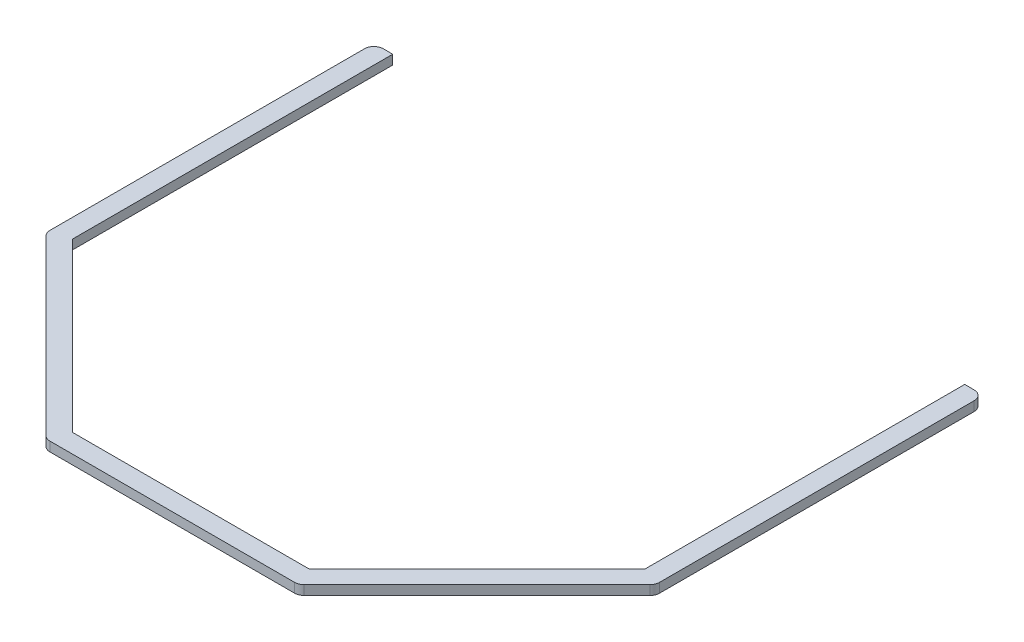
ISO-10303-21;
HEADER;
FILE_DESCRIPTION(('STEP AP214'),'2;1');
FILE_NAME('part.step','',(''),(''),'','','');
FILE_SCHEMA(('AUTOMOTIVE_DESIGN { 1 0 10303 214 1 1 1 1 }'));
ENDSEC;
DATA;
#1=APPLICATION_CONTEXT('core data for automotive mechanical design processes');
#2=APPLICATION_PROTOCOL_DEFINITION('international standard','automotive_design',2000,#1);
#3=PRODUCT_CONTEXT('',#1,'mechanical');
#4=PRODUCT('Part','Part','',(#3));
#5=PRODUCT_RELATED_PRODUCT_CATEGORY('part','',(#4));
#6=PRODUCT_DEFINITION_FORMATION('','',#4);
#7=PRODUCT_DEFINITION_CONTEXT('part definition',#1,'design');
#8=PRODUCT_DEFINITION('design','',#6,#7);
#9=PRODUCT_DEFINITION_SHAPE('','',#8);
#10=(LENGTH_UNIT() NAMED_UNIT(*) SI_UNIT(.MILLI.,.METRE.));
#11=(NAMED_UNIT(*) PLANE_ANGLE_UNIT() SI_UNIT($,.RADIAN.));
#12=(NAMED_UNIT(*) SI_UNIT($,.STERADIAN.) SOLID_ANGLE_UNIT());
#13=UNCERTAINTY_MEASURE_WITH_UNIT(LENGTH_MEASURE(1.E-05),#10,'distance_accuracy_value','');
#14=(GEOMETRIC_REPRESENTATION_CONTEXT(3) GLOBAL_UNCERTAINTY_ASSIGNED_CONTEXT((#13)) GLOBAL_UNIT_ASSIGNED_CONTEXT((#10,
#11,#12)) REPRESENTATION_CONTEXT('',''));
#15=CARTESIAN_POINT('',(0.,0.,0.));
#16=DIRECTION('',(0.,0.,1.));
#17=DIRECTION('',(1.,0.,0.));
#18=AXIS2_PLACEMENT_3D('',#15,#16,#17);
#19=CARTESIAN_POINT('',(-199.067689271226,6.35,-135.886792847484));
#20=DIRECTION('',(0.,0.,1.));
#21=DIRECTION('',(1.,0.,0.));
#22=AXIS2_PLACEMENT_3D('',#19,#20,#21);
#23=PLANE('',#22);
#24=DIRECTION('',(-1.,0.,0.));
#25=VECTOR('',#24,1.);
#26=CARTESIAN_POINT('',(-199.067689271226,0.,-135.886792847484));
#27=LINE('',#26,#25);
#28=CARTESIAN_POINT('',(-192.717689271226,0.,-135.886792847484));
#29=VERTEX_POINT('',#28);
#30=CARTESIAN_POINT('',(-199.067689271226,0.,-135.886792847484));
#31=VERTEX_POINT('',#30);
#32=EDGE_CURVE('E186',#29,#31,#27,.T.);
#33=ORIENTED_EDGE('',*,*,#32,.T.);
#34=DIRECTION('',(0.,-1.,0.));
#35=VECTOR('',#34,1.);
#36=CARTESIAN_POINT('',(-199.067689271226,6.35,-135.886792847484));
#37=LINE('',#36,#35);
#38=CARTESIAN_POINT('',(-199.067689271226,6.35,-135.886792847484));
#39=VERTEX_POINT('',#38);
#40=EDGE_CURVE('E11',#39,#31,#37,.T.);
#41=ORIENTED_EDGE('',*,*,#40,.F.);
#42=DIRECTION('',(-1.,0.,0.));
#43=VECTOR('',#42,1.);
#44=CARTESIAN_POINT('',(-199.067689271226,6.35,-135.886792847484));
#45=LINE('',#44,#43);
#46=CARTESIAN_POINT('',(-192.717689271226,6.35,-135.886792847484));
#47=VERTEX_POINT('',#46);
#48=EDGE_CURVE('E222',#47,#39,#45,.T.);
#49=ORIENTED_EDGE('',*,*,#48,.F.);
#50=DIRECTION('',(0.,-1.,0.));
#51=VECTOR('',#50,1.);
#52=CARTESIAN_POINT('',(-192.717689271226,6.35,-135.886792847484));
#53=LINE('',#52,#51);
#54=EDGE_CURVE('E182',#47,#29,#53,.T.);
#55=ORIENTED_EDGE('',*,*,#54,.T.);
#56=EDGE_LOOP('',(#33,#41,#49,#55));
#57=FACE_BOUND('',#56,.T.);
#58=ADVANCED_FACE('F30',(#57),#23,.F.);
#59=CARTESIAN_POINT('',(-199.067689271226,6.35,-129.536792847484));
#60=DIRECTION('',(0.,-1.,0.));
#61=DIRECTION('',(0.,0.,-1.));
#62=AXIS2_PLACEMENT_3D('',#59,#60,#61);
#63=CYLINDRICAL_SURFACE('',#62,6.34999999999999);
#64=CARTESIAN_POINT('',(-199.067689271226,0.,-129.536792847484));
#65=DIRECTION('',(0.,1.,0.));
#66=DIRECTION('',(0.,0.,-1.));
#67=AXIS2_PLACEMENT_3D('',#64,#65,#66);
#68=CIRCLE('',#67,6.34999999999999);
#69=CARTESIAN_POINT('',(-205.417689271226,0.,-129.536792847484));
#70=VERTEX_POINT('',#69);
#71=EDGE_CURVE('E189',#31,#70,#68,.T.);
#72=ORIENTED_EDGE('',*,*,#71,.T.);
#73=DIRECTION('',(0.,-1.,0.));
#74=VECTOR('',#73,1.);
#75=CARTESIAN_POINT('',(-205.417689271226,6.35,-129.536792847484));
#76=LINE('',#75,#74);
#77=CARTESIAN_POINT('',(-205.417689271226,6.35,-129.536792847484));
#78=VERTEX_POINT('',#77);
#79=EDGE_CURVE('E38',#78,#70,#76,.T.);
#80=ORIENTED_EDGE('',*,*,#79,.F.);
#81=CARTESIAN_POINT('',(-199.067689271226,6.35,-129.536792847484));
#82=DIRECTION('',(0.,1.,0.));
#83=DIRECTION('',(0.,0.,-1.));
#84=AXIS2_PLACEMENT_3D('',#81,#82,#83);
#85=CIRCLE('',#84,6.34999999999999);
#86=EDGE_CURVE('E119',#39,#78,#85,.T.);
#87=ORIENTED_EDGE('',*,*,#86,.F.);
#88=ORIENTED_EDGE('',*,*,#40,.T.);
#89=EDGE_LOOP('',(#72,#80,#87,#88));
#90=FACE_BOUND('',#89,.T.);
#91=ADVANCED_FACE('F267',(#90),#63,.T.);
#92=CARTESIAN_POINT('',(-205.417689271226,6.35,-85.0867928474841));
#93=DIRECTION('',(1.,0.,0.));
#94=DIRECTION('',(0.,0.,-1.));
#95=AXIS2_PLACEMENT_3D('',#92,#93,#94);
#96=PLANE('',#95);
#97=DIRECTION('',(0.,0.,1.));
#98=VECTOR('',#97,1.);
#99=CARTESIAN_POINT('',(-205.417689271226,0.,-85.0867928474841));
#100=LINE('',#99,#98);
#101=CARTESIAN_POINT('',(-205.417689271226,0.,82.4565367264149));
#102=VERTEX_POINT('',#101);
#103=EDGE_CURVE('E192',#70,#102,#100,.T.);
#104=ORIENTED_EDGE('',*,*,#103,.T.);
#105=DIRECTION('',(0.,-1.,0.));
#106=VECTOR('',#105,1.);
#107=CARTESIAN_POINT('',(-205.417689271226,6.35,82.4565367264149));
#108=LINE('',#107,#106);
#109=CARTESIAN_POINT('',(-205.417689271226,6.35,82.4565367264149));
#110=VERTEX_POINT('',#109);
#111=EDGE_CURVE('E259',#110,#102,#108,.T.);
#112=ORIENTED_EDGE('',*,*,#111,.F.);
#113=DIRECTION('',(0.,0.,1.));
#114=VECTOR('',#113,1.);
#115=CARTESIAN_POINT('',(-205.417689271226,6.35,-85.0867928474841));
#116=LINE('',#115,#114);
#117=EDGE_CURVE('E266',#78,#110,#116,.T.);
#118=ORIENTED_EDGE('',*,*,#117,.F.);
#119=ORIENTED_EDGE('',*,*,#79,.T.);
#120=EDGE_LOOP('',(#104,#112,#118,#119));
#121=FACE_BOUND('',#120,.T.);
#122=ADVANCED_FACE('F264',(#121),#96,.F.);
#123=CARTESIAN_POINT('',(-199.067689271226,6.35,82.4565367264149));
#124=DIRECTION('',(0.,-1.,0.));
#125=DIRECTION('',(0.,0.,-1.));
#126=AXIS2_PLACEMENT_3D('',#123,#124,#125);
#127=CYLINDRICAL_SURFACE('',#126,6.34999999999999);
#128=CARTESIAN_POINT('',(-199.067689271226,0.,82.4565367264149));
#129=DIRECTION('',(0.,1.,0.));
#130=DIRECTION('',(0.,0.,1.));
#131=AXIS2_PLACEMENT_3D('',#128,#129,#130);
#132=CIRCLE('',#131,6.34999999999999);
#133=CARTESIAN_POINT('',(-203.557817331761,0.,86.9466647869495));
#134=VERTEX_POINT('',#133);
#135=EDGE_CURVE('E194',#102,#134,#132,.T.);
#136=ORIENTED_EDGE('',*,*,#135,.T.);
#137=DIRECTION('',(0.,-1.,0.));
#138=VECTOR('',#137,1.);
#139=CARTESIAN_POINT('',(-203.557817331761,6.35,86.9466647869495));
#140=LINE('',#139,#138);
#141=CARTESIAN_POINT('',(-203.557817331761,6.35,86.9466647869495));
#142=VERTEX_POINT('',#141);
#143=EDGE_CURVE('E256',#142,#134,#140,.T.);
#144=ORIENTED_EDGE('',*,*,#143,.F.);
#145=CARTESIAN_POINT('',(-199.067689271226,6.35,82.4565367264149));
#146=DIRECTION('',(0.,1.,0.));
#147=DIRECTION('',(0.,0.,1.));
#148=AXIS2_PLACEMENT_3D('',#145,#146,#147);
#149=CIRCLE('',#148,6.34999999999999);
#150=EDGE_CURVE('E286',#110,#142,#149,.T.);
#151=ORIENTED_EDGE('',*,*,#150,.F.);
#152=ORIENTED_EDGE('',*,*,#111,.T.);
#153=EDGE_LOOP('',(#136,#144,#151,#152));
#154=FACE_BOUND('',#153,.T.);
#155=ADVANCED_FACE('F277',(#154),#127,.T.);
#156=CARTESIAN_POINT('',(-203.557817331761,6.35,86.9466647869495));
#157=DIRECTION('',(0.707106781186548,0.,-0.707106781186548));
#158=DIRECTION('',(-0.707106781186548,0.,-0.707106781186548));
#159=AXIS2_PLACEMENT_3D('',#156,#157,#158);
#160=PLANE('',#159);
#161=DIRECTION('',(0.707106781186548,0.,0.707106781186548));
#162=VECTOR('',#161,1.);
#163=CARTESIAN_POINT('',(-203.557817331761,0.,86.9466647869495));
#164=LINE('',#163,#162);
#165=CARTESIAN_POINT('',(-86.9466647869494,0.,203.557817331761));
#166=VERTEX_POINT('',#165);
#167=EDGE_CURVE('E196',#134,#166,#164,.T.);
#168=ORIENTED_EDGE('',*,*,#167,.T.);
#169=DIRECTION('',(0.,-1.,0.));
#170=VECTOR('',#169,1.);
#171=CARTESIAN_POINT('',(-86.9466647869494,6.35,203.557817331761));
#172=LINE('',#171,#170);
#173=CARTESIAN_POINT('',(-86.9466647869494,6.35,203.557817331761));
#174=VERTEX_POINT('',#173);
#175=EDGE_CURVE('E253',#174,#166,#172,.T.);
#176=ORIENTED_EDGE('',*,*,#175,.F.);
#177=DIRECTION('',(0.707106781186548,0.,0.707106781186548));
#178=VECTOR('',#177,1.);
#179=CARTESIAN_POINT('',(-203.557817331761,6.35,86.9466647869495));
#180=LINE('',#179,#178);
#181=EDGE_CURVE('E283',#142,#174,#180,.T.);
#182=ORIENTED_EDGE('',*,*,#181,.F.);
#183=ORIENTED_EDGE('',*,*,#143,.T.);
#184=EDGE_LOOP('',(#168,#176,#182,#183));
#185=FACE_BOUND('',#184,.T.);
#186=ADVANCED_FACE('F281',(#185),#160,.F.);
#187=CARTESIAN_POINT('',(-82.4565367264148,6.35,199.067689271226));
#188=DIRECTION('',(0.,-1.,0.));
#189=DIRECTION('',(0.,0.,-1.));
#190=AXIS2_PLACEMENT_3D('',#187,#188,#189);
#191=CYLINDRICAL_SURFACE('',#190,6.34999999999999);
#192=CARTESIAN_POINT('',(-82.4565367264148,0.,199.067689271226));
#193=DIRECTION('',(0.,1.,0.));
#194=DIRECTION('',(0.,0.,1.));
#195=AXIS2_PLACEMENT_3D('',#192,#193,#194);
#196=CIRCLE('',#195,6.34999999999999);
#197=CARTESIAN_POINT('',(-82.4565367264148,0.,205.417689271226));
#198=VERTEX_POINT('',#197);
#199=EDGE_CURVE('E198',#166,#198,#196,.T.);
#200=ORIENTED_EDGE('',*,*,#199,.T.);
#201=DIRECTION('',(0.,-1.,0.));
#202=VECTOR('',#201,1.);
#203=CARTESIAN_POINT('',(-82.4565367264148,6.35,205.417689271226));
#204=LINE('',#203,#202);
#205=CARTESIAN_POINT('',(-82.4565367264148,6.35,205.417689271226));
#206=VERTEX_POINT('',#205);
#207=EDGE_CURVE('E250',#206,#198,#204,.T.);
#208=ORIENTED_EDGE('',*,*,#207,.F.);
#209=CARTESIAN_POINT('',(-82.4565367264148,6.35,199.067689271226));
#210=DIRECTION('',(0.,1.,0.));
#211=DIRECTION('',(0.,0.,1.));
#212=AXIS2_PLACEMENT_3D('',#209,#210,#211);
#213=CIRCLE('',#212,6.34999999999999);
#214=EDGE_CURVE('E285',#174,#206,#213,.T.);
#215=ORIENTED_EDGE('',*,*,#214,.F.);
#216=ORIENTED_EDGE('',*,*,#175,.T.);
#217=EDGE_LOOP('',(#200,#208,#215,#216));
#218=FACE_BOUND('',#217,.T.);
#219=ADVANCED_FACE('F351',(#218),#191,.T.);
#220=CARTESIAN_POINT('',(-82.4565367264148,6.35,205.417689271226));
#221=DIRECTION('',(0.,0.,-1.));
#222=DIRECTION('',(-1.,0.,0.));
#223=AXIS2_PLACEMENT_3D('',#220,#221,#222);
#224=PLANE('',#223);
#225=DIRECTION('',(1.,0.,0.));
#226=VECTOR('',#225,1.);
#227=CARTESIAN_POINT('',(-82.4565367264148,0.,205.417689271226));
#228=LINE('',#227,#226);
#229=CARTESIAN_POINT('',(82.4565367264149,0.,205.417689271226));
#230=VERTEX_POINT('',#229);
#231=EDGE_CURVE('E200',#198,#230,#228,.T.);
#232=ORIENTED_EDGE('',*,*,#231,.T.);
#233=DIRECTION('',(0.,-1.,0.));
#234=VECTOR('',#233,1.);
#235=CARTESIAN_POINT('',(82.4565367264149,6.35,205.417689271226));
#236=LINE('',#235,#234);
#237=CARTESIAN_POINT('',(82.4565367264149,6.35,205.417689271226));
#238=VERTEX_POINT('',#237);
#239=EDGE_CURVE('E247',#238,#230,#236,.T.);
#240=ORIENTED_EDGE('',*,*,#239,.F.);
#241=DIRECTION('',(1.,0.,0.));
#242=VECTOR('',#241,1.);
#243=CARTESIAN_POINT('',(-82.4565367264148,6.35,205.417689271226));
#244=LINE('',#243,#242);
#245=EDGE_CURVE('E288',#206,#238,#244,.T.);
#246=ORIENTED_EDGE('',*,*,#245,.F.);
#247=ORIENTED_EDGE('',*,*,#207,.T.);
#248=EDGE_LOOP('',(#232,#240,#246,#247));
#249=FACE_BOUND('',#248,.T.);
#250=ADVANCED_FACE('F348',(#249),#224,.F.);
#251=CARTESIAN_POINT('',(82.456536726415,6.35,199.067689271226));
#252=DIRECTION('',(0.,-1.,0.));
#253=DIRECTION('',(0.,0.,-1.));
#254=AXIS2_PLACEMENT_3D('',#251,#252,#253);
#255=CYLINDRICAL_SURFACE('',#254,6.34999999999999);
#256=CARTESIAN_POINT('',(82.456536726415,0.,199.067689271226));
#257=DIRECTION('',(0.,1.,0.));
#258=DIRECTION('',(0.,0.,1.));
#259=AXIS2_PLACEMENT_3D('',#256,#257,#258);
#260=CIRCLE('',#259,6.34999999999999);
#261=CARTESIAN_POINT('',(86.9466647869495,0.,203.557817331761));
#262=VERTEX_POINT('',#261);
#263=EDGE_CURVE('E202',#230,#262,#260,.T.);
#264=ORIENTED_EDGE('',*,*,#263,.T.);
#265=DIRECTION('',(0.,-1.,0.));
#266=VECTOR('',#265,1.);
#267=CARTESIAN_POINT('',(86.9466647869495,6.35,203.557817331761));
#268=LINE('',#267,#266);
#269=CARTESIAN_POINT('',(86.9466647869495,6.35,203.557817331761));
#270=VERTEX_POINT('',#269);
#271=EDGE_CURVE('E244',#270,#262,#268,.T.);
#272=ORIENTED_EDGE('',*,*,#271,.F.);
#273=CARTESIAN_POINT('',(82.456536726415,6.35,199.067689271226));
#274=DIRECTION('',(0.,1.,0.));
#275=DIRECTION('',(0.,0.,1.));
#276=AXIS2_PLACEMENT_3D('',#273,#274,#275);
#277=CIRCLE('',#276,6.34999999999999);
#278=EDGE_CURVE('E294',#238,#270,#277,.T.);
#279=ORIENTED_EDGE('',*,*,#278,.F.);
#280=ORIENTED_EDGE('',*,*,#239,.T.);
#281=EDGE_LOOP('',(#264,#272,#279,#280));
#282=FACE_BOUND('',#281,.T.);
#283=ADVANCED_FACE('F343',(#282),#255,.T.);
#284=CARTESIAN_POINT('',(86.9466647869495,6.35,203.557817331761));
#285=DIRECTION('',(-0.707106781186548,0.,-0.707106781186547));
#286=DIRECTION('',(-0.707106781186547,0.,0.707106781186548));
#287=AXIS2_PLACEMENT_3D('',#284,#285,#286);
#288=PLANE('',#287);
#289=DIRECTION('',(0.707106781186547,0.,-0.707106781186548));
#290=VECTOR('',#289,1.);
#291=CARTESIAN_POINT('',(86.9466647869495,0.,203.557817331761));
#292=LINE('',#291,#290);
#293=CARTESIAN_POINT('',(203.557817331761,0.,86.9466647869494));
#294=VERTEX_POINT('',#293);
#295=EDGE_CURVE('E204',#262,#294,#292,.T.);
#296=ORIENTED_EDGE('',*,*,#295,.T.);
#297=DIRECTION('',(0.,-1.,0.));
#298=VECTOR('',#297,1.);
#299=CARTESIAN_POINT('',(203.557817331761,6.35,86.9466647869494));
#300=LINE('',#299,#298);
#301=CARTESIAN_POINT('',(203.557817331761,6.35,86.9466647869494));
#302=VERTEX_POINT('',#301);
#303=EDGE_CURVE('E241',#302,#294,#300,.T.);
#304=ORIENTED_EDGE('',*,*,#303,.F.);
#305=DIRECTION('',(0.707106781186547,0.,-0.707106781186548));
#306=VECTOR('',#305,1.);
#307=CARTESIAN_POINT('',(86.9466647869495,6.35,203.557817331761));
#308=LINE('',#307,#306);
#309=EDGE_CURVE('E296',#270,#302,#308,.T.);
#310=ORIENTED_EDGE('',*,*,#309,.F.);
#311=ORIENTED_EDGE('',*,*,#271,.T.);
#312=EDGE_LOOP('',(#296,#304,#310,#311));
#313=FACE_BOUND('',#312,.T.);
#314=ADVANCED_FACE('F338',(#313),#288,.F.);
#315=CARTESIAN_POINT('',(199.067689271226,6.35,82.4565367264149));
#316=DIRECTION('',(0.,-1.,0.));
#317=DIRECTION('',(0.,0.,-1.));
#318=AXIS2_PLACEMENT_3D('',#315,#316,#317);
#319=CYLINDRICAL_SURFACE('',#318,6.34999999999999);
#320=CARTESIAN_POINT('',(199.067689271226,0.,82.4565367264149));
#321=DIRECTION('',(0.,1.,0.));
#322=DIRECTION('',(0.,0.,1.));
#323=AXIS2_PLACEMENT_3D('',#320,#321,#322);
#324=CIRCLE('',#323,6.34999999999999);
#325=CARTESIAN_POINT('',(205.417689271226,0.,82.4565367264148));
#326=VERTEX_POINT('',#325);
#327=EDGE_CURVE('E206',#294,#326,#324,.T.);
#328=ORIENTED_EDGE('',*,*,#327,.T.);
#329=DIRECTION('',(0.,-1.,0.));
#330=VECTOR('',#329,1.);
#331=CARTESIAN_POINT('',(205.417689271226,6.35,82.4565367264148));
#332=LINE('',#331,#330);
#333=CARTESIAN_POINT('',(205.417689271226,6.35,82.4565367264148));
#334=VERTEX_POINT('',#333);
#335=EDGE_CURVE('E238',#334,#326,#332,.T.);
#336=ORIENTED_EDGE('',*,*,#335,.F.);
#337=CARTESIAN_POINT('',(199.067689271226,6.35,82.4565367264149));
#338=DIRECTION('',(0.,1.,0.));
#339=DIRECTION('',(0.,0.,1.));
#340=AXIS2_PLACEMENT_3D('',#337,#338,#339);
#341=CIRCLE('',#340,6.34999999999999);
#342=EDGE_CURVE('E298',#302,#334,#341,.T.);
#343=ORIENTED_EDGE('',*,*,#342,.F.);
#344=ORIENTED_EDGE('',*,*,#303,.T.);
#345=EDGE_LOOP('',(#328,#336,#343,#344));
#346=FACE_BOUND('',#345,.T.);
#347=ADVANCED_FACE('F333',(#346),#319,.T.);
#348=CARTESIAN_POINT('',(205.417689271226,6.35,-129.536792847484));
#349=DIRECTION('',(-1.,0.,0.));
#350=DIRECTION('',(0.,0.,1.));
#351=AXIS2_PLACEMENT_3D('',#348,#349,#350);
#352=PLANE('',#351);
#353=DIRECTION('',(0.,0.,-1.));
#354=VECTOR('',#353,1.);
#355=CARTESIAN_POINT('',(205.417689271226,0.,-129.536792847484));
#356=LINE('',#355,#354);
#357=CARTESIAN_POINT('',(205.417689271226,0.,-129.536792847484));
#358=VERTEX_POINT('',#357);
#359=EDGE_CURVE('E209',#326,#358,#356,.T.);
#360=ORIENTED_EDGE('',*,*,#359,.T.);
#361=DIRECTION('',(0.,-1.,0.));
#362=VECTOR('',#361,1.);
#363=CARTESIAN_POINT('',(205.417689271226,6.35,-129.536792847484));
#364=LINE('',#363,#362);
#365=CARTESIAN_POINT('',(205.417689271226,6.35,-129.536792847484));
#366=VERTEX_POINT('',#365);
#367=EDGE_CURVE('E235',#366,#358,#364,.T.);
#368=ORIENTED_EDGE('',*,*,#367,.F.);
#369=DIRECTION('',(0.,0.,-1.));
#370=VECTOR('',#369,1.);
#371=CARTESIAN_POINT('',(205.417689271226,6.35,82.4565367264148));
#372=LINE('',#371,#370);
#373=EDGE_CURVE('E300',#334,#366,#372,.T.);
#374=ORIENTED_EDGE('',*,*,#373,.F.);
#375=ORIENTED_EDGE('',*,*,#335,.T.);
#376=EDGE_LOOP('',(#360,#368,#374,#375));
#377=FACE_BOUND('',#376,.T.);
#378=ADVANCED_FACE('F328',(#377),#352,.F.);
#379=CARTESIAN_POINT('',(199.067689271226,6.35,-129.536792847484));
#380=DIRECTION('',(0.,-1.,0.));
#381=DIRECTION('',(0.,0.,-1.));
#382=AXIS2_PLACEMENT_3D('',#379,#380,#381);
#383=CYLINDRICAL_SURFACE('',#382,6.34999999999999);
#384=CARTESIAN_POINT('',(199.067689271226,0.,-129.536792847484));
#385=DIRECTION('',(0.,1.,0.));
#386=DIRECTION('',(0.,0.,-1.));
#387=AXIS2_PLACEMENT_3D('',#384,#385,#386);
#388=CIRCLE('',#387,6.34999999999999);
#389=CARTESIAN_POINT('',(199.067689271226,0.,-135.886792847484));
#390=VERTEX_POINT('',#389);
#391=EDGE_CURVE('E211',#358,#390,#388,.T.);
#392=ORIENTED_EDGE('',*,*,#391,.T.);
#393=DIRECTION('',(0.,-1.,0.));
#394=VECTOR('',#393,1.);
#395=CARTESIAN_POINT('',(199.067689271226,6.35,-135.886792847484));
#396=LINE('',#395,#394);
#397=CARTESIAN_POINT('',(199.067689271226,6.35,-135.886792847484));
#398=VERTEX_POINT('',#397);
#399=EDGE_CURVE('E232',#398,#390,#396,.T.);
#400=ORIENTED_EDGE('',*,*,#399,.F.);
#401=CARTESIAN_POINT('',(199.067689271226,6.35,-129.536792847484));
#402=DIRECTION('',(0.,1.,0.));
#403=DIRECTION('',(0.,0.,-1.));
#404=AXIS2_PLACEMENT_3D('',#401,#402,#403);
#405=CIRCLE('',#404,6.34999999999999);
#406=EDGE_CURVE('E302',#366,#398,#405,.T.);
#407=ORIENTED_EDGE('',*,*,#406,.F.);
#408=ORIENTED_EDGE('',*,*,#367,.T.);
#409=EDGE_LOOP('',(#392,#400,#407,#408));
#410=FACE_BOUND('',#409,.T.);
#411=ADVANCED_FACE('F324',(#410),#383,.T.);
#412=CARTESIAN_POINT('',(192.717689271226,6.35,-135.886792847484));
#413=DIRECTION('',(0.,0.,1.));
#414=DIRECTION('',(1.,0.,0.));
#415=AXIS2_PLACEMENT_3D('',#412,#413,#414);
#416=PLANE('',#415);
#417=DIRECTION('',(-1.,0.,0.));
#418=VECTOR('',#417,1.);
#419=CARTESIAN_POINT('',(192.717689271226,0.,-135.886792847484));
#420=LINE('',#419,#418);
#421=CARTESIAN_POINT('',(192.717689271226,0.,-135.886792847484));
#422=VERTEX_POINT('',#421);
#423=EDGE_CURVE('E213',#390,#422,#420,.T.);
#424=ORIENTED_EDGE('',*,*,#423,.T.);
#425=DIRECTION('',(0.,-1.,0.));
#426=VECTOR('',#425,1.);
#427=CARTESIAN_POINT('',(192.717689271226,6.35,-135.886792847484));
#428=LINE('',#427,#426);
#429=CARTESIAN_POINT('',(192.717689271226,6.35,-135.886792847484));
#430=VERTEX_POINT('',#429);
#431=EDGE_CURVE('E229',#430,#422,#428,.T.);
#432=ORIENTED_EDGE('',*,*,#431,.F.);
#433=DIRECTION('',(-1.,0.,0.));
#434=VECTOR('',#433,1.);
#435=CARTESIAN_POINT('',(192.717689271226,6.35,-135.886792847484));
#436=LINE('',#435,#434);
#437=EDGE_CURVE('E304',#398,#430,#436,.T.);
#438=ORIENTED_EDGE('',*,*,#437,.F.);
#439=ORIENTED_EDGE('',*,*,#399,.T.);
#440=EDGE_LOOP('',(#424,#432,#438,#439));
#441=FACE_BOUND('',#440,.T.);
#442=ADVANCED_FACE('F320',(#441),#416,.F.);
#443=CARTESIAN_POINT('',(192.717689271226,6.35,79.8262806053457));
#444=DIRECTION('',(1.,0.,0.));
#445=DIRECTION('',(0.,0.,-1.));
#446=AXIS2_PLACEMENT_3D('',#443,#444,#445);
#447=PLANE('',#446);
#448=DIRECTION('',(0.,0.,1.));
#449=VECTOR('',#448,1.);
#450=CARTESIAN_POINT('',(192.717689271226,0.,79.8262806053457));
#451=LINE('',#450,#449);
#452=CARTESIAN_POINT('',(192.717689271226,0.,79.8262806053457));
#453=VERTEX_POINT('',#452);
#454=EDGE_CURVE('E215',#422,#453,#451,.T.);
#455=ORIENTED_EDGE('',*,*,#454,.T.);
#456=DIRECTION('',(0.,-1.,0.));
#457=VECTOR('',#456,1.);
#458=CARTESIAN_POINT('',(192.717689271226,6.35,79.8262806053457));
#459=LINE('',#458,#457);
#460=CARTESIAN_POINT('',(192.717689271226,6.35,79.8262806053457));
#461=VERTEX_POINT('',#460);
#462=EDGE_CURVE('E226',#461,#453,#459,.T.);
#463=ORIENTED_EDGE('',*,*,#462,.F.);
#464=DIRECTION('',(0.,0.,1.));
#465=VECTOR('',#464,1.);
#466=CARTESIAN_POINT('',(192.717689271226,6.35,79.8262806053457));
#467=LINE('',#466,#465);
#468=EDGE_CURVE('E306',#430,#461,#467,.T.);
#469=ORIENTED_EDGE('',*,*,#468,.F.);
#470=ORIENTED_EDGE('',*,*,#431,.T.);
#471=EDGE_LOOP('',(#455,#463,#469,#470));
#472=FACE_BOUND('',#471,.T.);
#473=ADVANCED_FACE('F312',(#472),#447,.F.);
#474=CARTESIAN_POINT('',(79.8262806053457,6.35,192.717689271226));
#475=DIRECTION('',(0.707106781186548,0.,0.707106781186547));
#476=DIRECTION('',(0.707106781186547,0.,-0.707106781186548));
#477=AXIS2_PLACEMENT_3D('',#474,#475,#476);
#478=PLANE('',#477);
#479=DIRECTION('',(-0.707106781186547,0.,0.707106781186548));
#480=VECTOR('',#479,1.);
#481=CARTESIAN_POINT('',(79.8262806053457,0.,192.717689271226));
#482=LINE('',#481,#480);
#483=CARTESIAN_POINT('',(79.8262806053457,0.,192.717689271226));
#484=VERTEX_POINT('',#483);
#485=EDGE_CURVE('E217',#453,#484,#482,.T.);
#486=ORIENTED_EDGE('',*,*,#485,.T.);
#487=DIRECTION('',(0.,-1.,0.));
#488=VECTOR('',#487,1.);
#489=CARTESIAN_POINT('',(79.8262806053457,6.35,192.717689271226));
#490=LINE('',#489,#488);
#491=CARTESIAN_POINT('',(79.8262806053457,6.35,192.717689271226));
#492=VERTEX_POINT('',#491);
#493=EDGE_CURVE('E177',#492,#484,#490,.T.);
#494=ORIENTED_EDGE('',*,*,#493,.F.);
#495=DIRECTION('',(-0.707106781186547,0.,0.707106781186548));
#496=VECTOR('',#495,1.);
#497=CARTESIAN_POINT('',(79.8262806053457,6.35,192.717689271226));
#498=LINE('',#497,#496);
#499=EDGE_CURVE('E168',#461,#492,#498,.T.);
#500=ORIENTED_EDGE('',*,*,#499,.F.);
#501=ORIENTED_EDGE('',*,*,#462,.T.);
#502=EDGE_LOOP('',(#486,#494,#500,#501));
#503=FACE_BOUND('',#502,.T.);
#504=ADVANCED_FACE('F316',(#503),#478,.F.);
#505=CARTESIAN_POINT('',(-79.8262806053457,6.35,192.717689271226));
#506=DIRECTION('',(0.,0.,1.));
#507=DIRECTION('',(1.,0.,0.));
#508=AXIS2_PLACEMENT_3D('',#505,#506,#507);
#509=PLANE('',#508);
#510=DIRECTION('',(-1.,0.,0.));
#511=VECTOR('',#510,1.);
#512=CARTESIAN_POINT('',(-79.8262806053457,0.,192.717689271226));
#513=LINE('',#512,#511);
#514=CARTESIAN_POINT('',(-79.8262806053457,0.,192.717689271226));
#515=VERTEX_POINT('',#514);
#516=EDGE_CURVE('E176',#484,#515,#513,.T.);
#517=ORIENTED_EDGE('',*,*,#516,.T.);
#518=DIRECTION('',(0.,-1.,0.));
#519=VECTOR('',#518,1.);
#520=CARTESIAN_POINT('',(-79.8262806053457,6.35,192.717689271226));
#521=LINE('',#520,#519);
#522=CARTESIAN_POINT('',(-79.8262806053457,6.35,192.717689271226));
#523=VERTEX_POINT('',#522);
#524=EDGE_CURVE('E173',#523,#515,#521,.T.);
#525=ORIENTED_EDGE('',*,*,#524,.F.);
#526=DIRECTION('',(-1.,0.,0.));
#527=VECTOR('',#526,1.);
#528=CARTESIAN_POINT('',(-79.8262806053457,6.35,192.717689271226));
#529=LINE('',#528,#527);
#530=EDGE_CURVE('E162',#492,#523,#529,.T.);
#531=ORIENTED_EDGE('',*,*,#530,.F.);
#532=ORIENTED_EDGE('',*,*,#493,.T.);
#533=EDGE_LOOP('',(#517,#525,#531,#532));
#534=FACE_BOUND('',#533,.T.);
#535=ADVANCED_FACE('F174',(#534),#509,.F.);
#536=CARTESIAN_POINT('',(-192.717689271226,6.35,79.8262806053457));
#537=DIRECTION('',(-0.707106781186547,0.,0.707106781186548));
#538=DIRECTION('',(0.707106781186548,0.,0.707106781186547));
#539=AXIS2_PLACEMENT_3D('',#536,#537,#538);
#540=PLANE('',#539);
#541=DIRECTION('',(-0.707106781186548,0.,-0.707106781186547));
#542=VECTOR('',#541,1.);
#543=CARTESIAN_POINT('',(-192.717689271226,0.,79.8262806053457));
#544=LINE('',#543,#542);
#545=CARTESIAN_POINT('',(-192.717689271226,0.,79.8262806053457));
#546=VERTEX_POINT('',#545);
#547=EDGE_CURVE('E105',#515,#546,#544,.T.);
#548=ORIENTED_EDGE('',*,*,#547,.T.);
#549=DIRECTION('',(0.,-1.,0.));
#550=VECTOR('',#549,1.);
#551=CARTESIAN_POINT('',(-192.717689271226,6.35,79.8262806053457));
#552=LINE('',#551,#550);
#553=CARTESIAN_POINT('',(-192.717689271226,6.35,79.8262806053457));
#554=VERTEX_POINT('',#553);
#555=EDGE_CURVE('E178',#554,#546,#552,.T.);
#556=ORIENTED_EDGE('',*,*,#555,.F.);
#557=DIRECTION('',(-0.707106781186548,0.,-0.707106781186547));
#558=VECTOR('',#557,1.);
#559=CARTESIAN_POINT('',(-192.717689271226,6.35,79.8262806053457));
#560=LINE('',#559,#558);
#561=EDGE_CURVE('E166',#523,#554,#560,.T.);
#562=ORIENTED_EDGE('',*,*,#561,.F.);
#563=ORIENTED_EDGE('',*,*,#524,.T.);
#564=EDGE_LOOP('',(#548,#556,#562,#563));
#565=FACE_BOUND('',#564,.T.);
#566=ADVANCED_FACE('F180',(#565),#540,.F.);
#567=CARTESIAN_POINT('',(-192.717689271226,6.35,-135.886792847484));
#568=DIRECTION('',(-1.,0.,0.));
#569=DIRECTION('',(0.,0.,1.));
#570=AXIS2_PLACEMENT_3D('',#567,#568,#569);
#571=PLANE('',#570);
#572=DIRECTION('',(0.,0.,-1.));
#573=VECTOR('',#572,1.);
#574=CARTESIAN_POINT('',(-192.717689271226,0.,-135.886792847484));
#575=LINE('',#574,#573);
#576=EDGE_CURVE('E111',#546,#29,#575,.T.);
#577=ORIENTED_EDGE('',*,*,#576,.T.);
#578=ORIENTED_EDGE('',*,*,#54,.F.);
#579=DIRECTION('',(0.,0.,-1.));
#580=VECTOR('',#579,1.);
#581=CARTESIAN_POINT('',(-192.717689271226,6.35,-135.886792847484));
#582=LINE('',#581,#580);
#583=EDGE_CURVE('E46',#554,#47,#582,.T.);
#584=ORIENTED_EDGE('',*,*,#583,.F.);
#585=ORIENTED_EDGE('',*,*,#555,.T.);
#586=EDGE_LOOP('',(#577,#578,#584,#585));
#587=FACE_BOUND('',#586,.T.);
#588=ADVANCED_FACE('F366',(#587),#571,.F.);
#589=CARTESIAN_POINT('',(199.067689271226,6.35,-129.536792847484));
#590=DIRECTION('',(0.,-1.,0.));
#591=DIRECTION('',(0.,0.,-1.));
#592=AXIS2_PLACEMENT_3D('',#589,#590,#591);
#593=PLANE('',#592);
#594=ORIENTED_EDGE('',*,*,#48,.T.);
#595=ORIENTED_EDGE('',*,*,#86,.T.);
#596=ORIENTED_EDGE('',*,*,#117,.T.);
#597=ORIENTED_EDGE('',*,*,#150,.T.);
#598=ORIENTED_EDGE('',*,*,#181,.T.);
#599=ORIENTED_EDGE('',*,*,#214,.T.);
#600=ORIENTED_EDGE('',*,*,#245,.T.);
#601=ORIENTED_EDGE('',*,*,#278,.T.);
#602=ORIENTED_EDGE('',*,*,#309,.T.);
#603=ORIENTED_EDGE('',*,*,#342,.T.);
#604=ORIENTED_EDGE('',*,*,#373,.T.);
#605=ORIENTED_EDGE('',*,*,#406,.T.);
#606=ORIENTED_EDGE('',*,*,#437,.T.);
#607=ORIENTED_EDGE('',*,*,#468,.T.);
#608=ORIENTED_EDGE('',*,*,#499,.T.);
#609=ORIENTED_EDGE('',*,*,#530,.T.);
#610=ORIENTED_EDGE('',*,*,#561,.T.);
#611=ORIENTED_EDGE('',*,*,#583,.T.);
#612=EDGE_LOOP('',(#594,#595,#596,#597,#598,#599,#600,#601,#602,#603,#604,#605,#606,#607,#608,
#609,#610,#611));
#613=FACE_BOUND('',#612,.T.);
#614=ADVANCED_FACE('F164',(#613),#593,.F.);
#615=CARTESIAN_POINT('',(199.067689271226,0.,-129.536792847484));
#616=DIRECTION('',(0.,-1.,0.));
#617=DIRECTION('',(0.,0.,-1.));
#618=AXIS2_PLACEMENT_3D('',#615,#616,#617);
#619=PLANE('',#618);
#620=ORIENTED_EDGE('',*,*,#32,.F.);
#621=ORIENTED_EDGE('',*,*,#576,.F.);
#622=ORIENTED_EDGE('',*,*,#547,.F.);
#623=ORIENTED_EDGE('',*,*,#516,.F.);
#624=ORIENTED_EDGE('',*,*,#485,.F.);
#625=ORIENTED_EDGE('',*,*,#454,.F.);
#626=ORIENTED_EDGE('',*,*,#423,.F.);
#627=ORIENTED_EDGE('',*,*,#391,.F.);
#628=ORIENTED_EDGE('',*,*,#359,.F.);
#629=ORIENTED_EDGE('',*,*,#327,.F.);
#630=ORIENTED_EDGE('',*,*,#295,.F.);
#631=ORIENTED_EDGE('',*,*,#263,.F.);
#632=ORIENTED_EDGE('',*,*,#231,.F.);
#633=ORIENTED_EDGE('',*,*,#199,.F.);
#634=ORIENTED_EDGE('',*,*,#167,.F.);
#635=ORIENTED_EDGE('',*,*,#135,.F.);
#636=ORIENTED_EDGE('',*,*,#103,.F.);
#637=ORIENTED_EDGE('',*,*,#71,.F.);
#638=EDGE_LOOP('',(#620,#621,#622,#623,#624,#625,#626,#627,#628,#629,#630,#631,#632,#633,#634,
#635,#636,#637));
#639=FACE_BOUND('',#638,.T.);
#640=ADVANCED_FACE('F271',(#639),#619,.T.);
#641=CLOSED_SHELL('',(#58,#91,#122,#155,#186,#219,#250,#283,#314,#347,#378,#411,#442,#473,#504,
#535,#566,#588,#614,#640));
#642=MANIFOLD_SOLID_BREP('B2',#641);
#643=ADVANCED_BREP_SHAPE_REPRESENTATION('',(#18,#642),#14);
#644=SHAPE_DEFINITION_REPRESENTATION(#9,#643);
ENDSEC;
END-ISO-10303-21;
